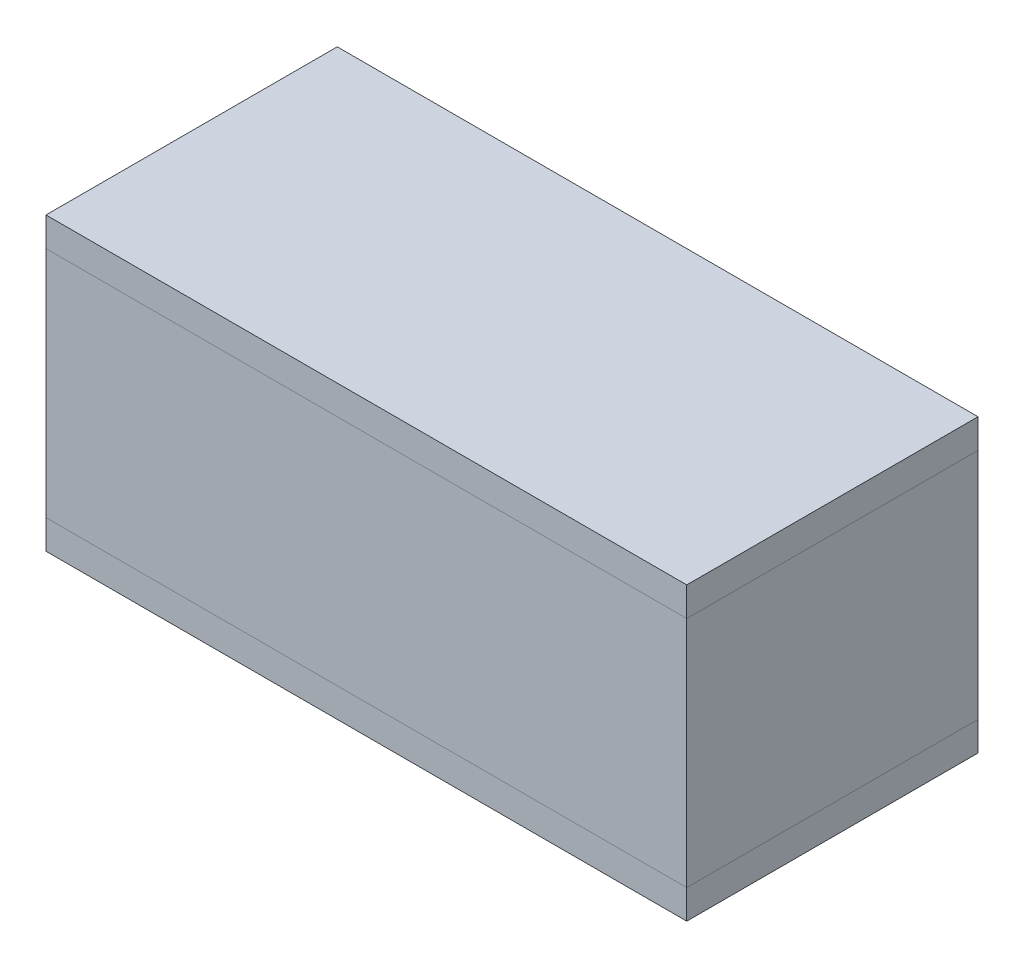
ISO-10303-21;
HEADER;
FILE_DESCRIPTION(('STEP AP214'),'2;1');
FILE_NAME('part.step','',(''),(''),'','','');
FILE_SCHEMA(('AUTOMOTIVE_DESIGN { 1 0 10303 214 1 1 1 1 }'));
ENDSEC;
DATA;
#1=APPLICATION_CONTEXT('core data for automotive mechanical design processes');
#2=APPLICATION_PROTOCOL_DEFINITION('international standard','automotive_design',2000,#1);
#3=PRODUCT_CONTEXT('',#1,'mechanical');
#4=PRODUCT('Part','Part','',(#3));
#5=PRODUCT_RELATED_PRODUCT_CATEGORY('part','',(#4));
#6=PRODUCT_DEFINITION_FORMATION('','',#4);
#7=PRODUCT_DEFINITION_CONTEXT('part definition',#1,'design');
#8=PRODUCT_DEFINITION('design','',#6,#7);
#9=PRODUCT_DEFINITION_SHAPE('','',#8);
#10=(LENGTH_UNIT() NAMED_UNIT(*) SI_UNIT(.MILLI.,.METRE.));
#11=(NAMED_UNIT(*) PLANE_ANGLE_UNIT() SI_UNIT($,.RADIAN.));
#12=(NAMED_UNIT(*) SI_UNIT($,.STERADIAN.) SOLID_ANGLE_UNIT());
#13=UNCERTAINTY_MEASURE_WITH_UNIT(LENGTH_MEASURE(1.E-05),#10,'distance_accuracy_value','');
#14=(GEOMETRIC_REPRESENTATION_CONTEXT(3) GLOBAL_UNCERTAINTY_ASSIGNED_CONTEXT((#13)) GLOBAL_UNIT_ASSIGNED_CONTEXT((#10,
#11,#12)) REPRESENTATION_CONTEXT('',''));
#15=CARTESIAN_POINT('',(0.,0.,0.));
#16=DIRECTION('',(0.,0.,1.));
#17=DIRECTION('',(1.,0.,0.));
#18=AXIS2_PLACEMENT_3D('',#15,#16,#17);
#19=CARTESIAN_POINT('',(0.,45.,0.));
#20=DIRECTION('',(0.,1.,0.));
#21=DIRECTION('',(0.,0.,1.));
#22=AXIS2_PLACEMENT_3D('',#19,#20,#21);
#23=PLANE('',#22);
#24=DIRECTION('',(-1.,0.,0.));
#25=VECTOR('',#24,1.);
#26=CARTESIAN_POINT('',(-40.9090909090909,45.,-19.1136363636364));
#27=LINE('',#26,#25);
#28=CARTESIAN_POINT('',(69.0909090909091,45.,-19.1136363636364));
#29=VERTEX_POINT('',#28);
#30=CARTESIAN_POINT('',(-40.9090909090909,45.,-19.1136363636364));
#31=VERTEX_POINT('',#30);
#32=EDGE_CURVE('E114',#29,#31,#27,.T.);
#33=ORIENTED_EDGE('',*,*,#32,.T.);
#34=DIRECTION('',(0.,0.,1.));
#35=VECTOR('',#34,1.);
#36=CARTESIAN_POINT('',(-40.9090909090909,45.,-19.1136363636364));
#37=LINE('',#36,#35);
#38=CARTESIAN_POINT('',(-40.9090909090909,45.,30.8863636363636));
#39=VERTEX_POINT('',#38);
#40=EDGE_CURVE('E124',#31,#39,#37,.T.);
#41=ORIENTED_EDGE('',*,*,#40,.T.);
#42=DIRECTION('',(1.,0.,0.));
#43=VECTOR('',#42,1.);
#44=CARTESIAN_POINT('',(-40.9090909090909,45.,30.8863636363636));
#45=LINE('',#44,#43);
#46=CARTESIAN_POINT('',(69.0909090909091,45.,30.8863636363636));
#47=VERTEX_POINT('',#46);
#48=EDGE_CURVE('E146',#39,#47,#45,.T.);
#49=ORIENTED_EDGE('',*,*,#48,.T.);
#50=DIRECTION('',(0.,0.,-1.));
#51=VECTOR('',#50,1.);
#52=CARTESIAN_POINT('',(69.0909090909091,45.,-19.1136363636364));
#53=LINE('',#52,#51);
#54=EDGE_CURVE('E135',#47,#29,#53,.T.);
#55=ORIENTED_EDGE('',*,*,#54,.T.);
#56=EDGE_LOOP('',(#33,#41,#49,#55));
#57=FACE_BOUND('',#56,.T.);
#58=DIRECTION('',(0.,0.,1.));
#59=VECTOR('',#58,1.);
#60=CARTESIAN_POINT('',(-39.4090909090909,45.,-19.1136363636364));
#61=LINE('',#60,#59);
#62=CARTESIAN_POINT('',(-39.4090909090909,45.,-17.6136363636364));
#63=VERTEX_POINT('',#62);
#64=CARTESIAN_POINT('',(-39.4090909090909,45.,29.3863636363636));
#65=VERTEX_POINT('',#64);
#66=EDGE_CURVE('E130',#63,#65,#61,.T.);
#67=ORIENTED_EDGE('',*,*,#66,.F.);
#68=DIRECTION('',(-1.,0.,0.));
#69=VECTOR('',#68,1.);
#70=CARTESIAN_POINT('',(-40.9090909090909,45.,-17.6136363636364));
#71=LINE('',#70,#69);
#72=CARTESIAN_POINT('',(67.5909090909091,45.,-17.6136363636364));
#73=VERTEX_POINT('',#72);
#74=EDGE_CURVE('E49',#73,#63,#71,.T.);
#75=ORIENTED_EDGE('',*,*,#74,.F.);
#76=DIRECTION('',(0.,0.,-1.));
#77=VECTOR('',#76,1.);
#78=CARTESIAN_POINT('',(67.5909090909091,45.,-19.1136363636364));
#79=LINE('',#78,#77);
#80=CARTESIAN_POINT('',(67.5909090909091,45.,29.3863636363636));
#81=VERTEX_POINT('',#80);
#82=EDGE_CURVE('E154',#81,#73,#79,.T.);
#83=ORIENTED_EDGE('',*,*,#82,.F.);
#84=DIRECTION('',(1.,0.,0.));
#85=VECTOR('',#84,1.);
#86=CARTESIAN_POINT('',(-40.9090909090909,45.,29.3863636363636));
#87=LINE('',#86,#85);
#88=EDGE_CURVE('E151',#65,#81,#87,.T.);
#89=ORIENTED_EDGE('',*,*,#88,.F.);
#90=EDGE_LOOP('',(#67,#75,#83,#89));
#91=FACE_BOUND('',#90,.T.);
#92=ADVANCED_FACE('F45',(#57,#91),#23,.T.);
#93=CARTESIAN_POINT('',(0.,4.99999999999999,0.));
#94=DIRECTION('',(0.,-1.,0.));
#95=DIRECTION('',(1.,0.,0.));
#96=AXIS2_PLACEMENT_3D('',#93,#94,#95);
#97=PLANE('',#96);
#98=DIRECTION('',(-1.,0.,0.));
#99=VECTOR('',#98,1.);
#100=CARTESIAN_POINT('',(-40.9090909090909,4.99999999999998,30.8863636363636));
#101=LINE('',#100,#99);
#102=CARTESIAN_POINT('',(69.0909090909091,5.,30.8863636363636));
#103=VERTEX_POINT('',#102);
#104=CARTESIAN_POINT('',(-40.9090909090909,4.99999999999999,30.8863636363636));
#105=VERTEX_POINT('',#104);
#106=EDGE_CURVE('E145',#103,#105,#101,.T.);
#107=ORIENTED_EDGE('',*,*,#106,.T.);
#108=DIRECTION('',(0.,0.,-1.));
#109=VECTOR('',#108,1.);
#110=CARTESIAN_POINT('',(-40.9090909090909,4.99999999999998,-19.1136363636364));
#111=LINE('',#110,#109);
#112=CARTESIAN_POINT('',(-40.9090909090909,4.99999999999999,-19.1136363636364));
#113=VERTEX_POINT('',#112);
#114=EDGE_CURVE('E131',#105,#113,#111,.T.);
#115=ORIENTED_EDGE('',*,*,#114,.T.);
#116=DIRECTION('',(1.,0.,0.));
#117=VECTOR('',#116,1.);
#118=CARTESIAN_POINT('',(-40.9090909090909,4.99999999999998,-19.1136363636364));
#119=LINE('',#118,#117);
#120=CARTESIAN_POINT('',(69.0909090909091,4.99999999999999,-19.1136363636364));
#121=VERTEX_POINT('',#120);
#122=EDGE_CURVE('E116',#113,#121,#119,.T.);
#123=ORIENTED_EDGE('',*,*,#122,.T.);
#124=DIRECTION('',(0.,0.,1.));
#125=VECTOR('',#124,1.);
#126=CARTESIAN_POINT('',(69.0909090909091,5.,-19.1136363636364));
#127=LINE('',#126,#125);
#128=EDGE_CURVE('E136',#121,#103,#127,.T.);
#129=ORIENTED_EDGE('',*,*,#128,.T.);
#130=EDGE_LOOP('',(#107,#115,#123,#129));
#131=FACE_BOUND('',#130,.T.);
#132=DIRECTION('',(0.,0.,-1.));
#133=VECTOR('',#132,1.);
#134=CARTESIAN_POINT('',(-39.4090909090909,4.99999999999998,-19.1136363636364));
#135=LINE('',#134,#133);
#136=CARTESIAN_POINT('',(-39.4090909090909,4.99999999999999,29.3863636363636));
#137=VERTEX_POINT('',#136);
#138=CARTESIAN_POINT('',(-39.4090909090909,4.99999999999999,-17.6136363636364));
#139=VERTEX_POINT('',#138);
#140=EDGE_CURVE('E150',#137,#139,#135,.T.);
#141=ORIENTED_EDGE('',*,*,#140,.F.);
#142=DIRECTION('',(-1.,0.,0.));
#143=VECTOR('',#142,1.);
#144=CARTESIAN_POINT('',(-40.9090909090909,4.99999999999998,29.3863636363636));
#145=LINE('',#144,#143);
#146=CARTESIAN_POINT('',(67.5909090909091,5.,29.3863636363636));
#147=VERTEX_POINT('',#146);
#148=EDGE_CURVE('E153',#147,#137,#145,.T.);
#149=ORIENTED_EDGE('',*,*,#148,.F.);
#150=DIRECTION('',(0.,0.,1.));
#151=VECTOR('',#150,1.);
#152=CARTESIAN_POINT('',(67.5909090909091,5.,-19.1136363636364));
#153=LINE('',#152,#151);
#154=CARTESIAN_POINT('',(67.5909090909091,4.99999999999999,-17.6136363636364));
#155=VERTEX_POINT('',#154);
#156=EDGE_CURVE('E155',#155,#147,#153,.T.);
#157=ORIENTED_EDGE('',*,*,#156,.F.);
#158=DIRECTION('',(1.,0.,0.));
#159=VECTOR('',#158,1.);
#160=CARTESIAN_POINT('',(-40.9090909090909,4.99999999999998,-17.6136363636364));
#161=LINE('',#160,#159);
#162=EDGE_CURVE('E68',#139,#155,#161,.T.);
#163=ORIENTED_EDGE('',*,*,#162,.F.);
#164=EDGE_LOOP('',(#141,#149,#157,#163));
#165=FACE_BOUND('',#164,.T.);
#166=ADVANCED_FACE('F188',(#131,#165),#97,.T.);
#167=CARTESIAN_POINT('',(-40.9090909090909,48.,29.3863636363636));
#168=DIRECTION('',(0.,0.,-1.));
#169=DIRECTION('',(-1.,0.,0.));
#170=AXIS2_PLACEMENT_3D('',#167,#168,#169);
#171=PLANE('',#170);
#172=DIRECTION('',(0.,-1.,0.));
#173=VECTOR('',#172,1.);
#174=CARTESIAN_POINT('',(-39.4090909090909,48.,29.3863636363636));
#175=LINE('',#174,#173);
#176=EDGE_CURVE('E120',#65,#137,#175,.T.);
#177=ORIENTED_EDGE('',*,*,#176,.F.);
#178=ORIENTED_EDGE('',*,*,#88,.T.);
#179=DIRECTION('',(0.,-1.,0.));
#180=VECTOR('',#179,1.);
#181=CARTESIAN_POINT('',(67.5909090909091,48.,29.3863636363636));
#182=LINE('',#181,#180);
#183=EDGE_CURVE('E174',#81,#147,#182,.T.);
#184=ORIENTED_EDGE('',*,*,#183,.T.);
#185=ORIENTED_EDGE('',*,*,#148,.T.);
#186=EDGE_LOOP('',(#177,#178,#184,#185));
#187=FACE_BOUND('',#186,.T.);
#188=ADVANCED_FACE('F198',(#187),#171,.T.);
#189=CARTESIAN_POINT('',(-39.4090909090909,48.,-19.1136363636364));
#190=DIRECTION('',(1.,0.,0.));
#191=DIRECTION('',(0.,0.,-1.));
#192=AXIS2_PLACEMENT_3D('',#189,#190,#191);
#193=PLANE('',#192);
#194=DIRECTION('',(0.,-1.,0.));
#195=VECTOR('',#194,1.);
#196=CARTESIAN_POINT('',(-39.4090909090909,48.,-17.6136363636364));
#197=LINE('',#196,#195);
#198=EDGE_CURVE('E12',#63,#139,#197,.T.);
#199=ORIENTED_EDGE('',*,*,#198,.F.);
#200=ORIENTED_EDGE('',*,*,#66,.T.);
#201=ORIENTED_EDGE('',*,*,#176,.T.);
#202=ORIENTED_EDGE('',*,*,#140,.T.);
#203=EDGE_LOOP('',(#199,#200,#201,#202));
#204=FACE_BOUND('',#203,.T.);
#205=ADVANCED_FACE('F186',(#204),#193,.T.);
#206=CARTESIAN_POINT('',(67.5909090909091,48.,-19.1136363636364));
#207=DIRECTION('',(-1.,0.,0.));
#208=DIRECTION('',(0.,0.,1.));
#209=AXIS2_PLACEMENT_3D('',#206,#207,#208);
#210=PLANE('',#209);
#211=ORIENTED_EDGE('',*,*,#183,.F.);
#212=ORIENTED_EDGE('',*,*,#82,.T.);
#213=DIRECTION('',(0.,-1.,0.));
#214=VECTOR('',#213,1.);
#215=CARTESIAN_POINT('',(67.5909090909091,48.,-17.6136363636364));
#216=LINE('',#215,#214);
#217=EDGE_CURVE('E54',#73,#155,#216,.T.);
#218=ORIENTED_EDGE('',*,*,#217,.T.);
#219=ORIENTED_EDGE('',*,*,#156,.T.);
#220=EDGE_LOOP('',(#211,#212,#218,#219));
#221=FACE_BOUND('',#220,.T.);
#222=ADVANCED_FACE('F189',(#221),#210,.T.);
#223=CARTESIAN_POINT('',(-40.9090909090909,48.,-17.6136363636364));
#224=DIRECTION('',(0.,0.,1.));
#225=DIRECTION('',(1.,0.,0.));
#226=AXIS2_PLACEMENT_3D('',#223,#224,#225);
#227=PLANE('',#226);
#228=ORIENTED_EDGE('',*,*,#217,.F.);
#229=ORIENTED_EDGE('',*,*,#74,.T.);
#230=ORIENTED_EDGE('',*,*,#198,.T.);
#231=ORIENTED_EDGE('',*,*,#162,.T.);
#232=EDGE_LOOP('',(#228,#229,#230,#231));
#233=FACE_BOUND('',#232,.T.);
#234=ADVANCED_FACE('F183',(#233),#227,.T.);
#235=CARTESIAN_POINT('',(-40.9090909090909,50.,30.8863636363636));
#236=DIRECTION('',(0.,0.,-1.));
#237=DIRECTION('',(-1.,0.,0.));
#238=AXIS2_PLACEMENT_3D('',#235,#236,#237);
#239=PLANE('',#238);
#240=ORIENTED_EDGE('',*,*,#48,.F.);
#241=DIRECTION('',(0.,-1.,0.));
#242=VECTOR('',#241,1.);
#243=CARTESIAN_POINT('',(-40.9090909090909,50.,30.8863636363636));
#244=LINE('',#243,#242);
#245=EDGE_CURVE('E126',#39,#105,#244,.T.);
#246=ORIENTED_EDGE('',*,*,#245,.T.);
#247=ORIENTED_EDGE('',*,*,#106,.F.);
#248=DIRECTION('',(0.,-1.,0.));
#249=VECTOR('',#248,1.);
#250=CARTESIAN_POINT('',(69.0909090909091,50.,30.8863636363636));
#251=LINE('',#250,#249);
#252=EDGE_CURVE('E178',#47,#103,#251,.T.);
#253=ORIENTED_EDGE('',*,*,#252,.F.);
#254=EDGE_LOOP('',(#240,#246,#247,#253));
#255=FACE_BOUND('',#254,.T.);
#256=ADVANCED_FACE('F196',(#255),#239,.F.);
#257=CARTESIAN_POINT('',(-40.9090909090909,50.,-19.1136363636364));
#258=DIRECTION('',(1.,0.,0.));
#259=DIRECTION('',(0.,0.,-1.));
#260=AXIS2_PLACEMENT_3D('',#257,#258,#259);
#261=PLANE('',#260);
#262=ORIENTED_EDGE('',*,*,#40,.F.);
#263=DIRECTION('',(0.,-1.,0.));
#264=VECTOR('',#263,1.);
#265=CARTESIAN_POINT('',(-40.9090909090909,50.,-19.1136363636364));
#266=LINE('',#265,#264);
#267=EDGE_CURVE('E111',#31,#113,#266,.T.);
#268=ORIENTED_EDGE('',*,*,#267,.T.);
#269=ORIENTED_EDGE('',*,*,#114,.F.);
#270=ORIENTED_EDGE('',*,*,#245,.F.);
#271=EDGE_LOOP('',(#262,#268,#269,#270));
#272=FACE_BOUND('',#271,.T.);
#273=ADVANCED_FACE('F125',(#272),#261,.F.);
#274=CARTESIAN_POINT('',(69.0909090909091,50.,-19.1136363636364));
#275=DIRECTION('',(-1.,0.,0.));
#276=DIRECTION('',(0.,0.,1.));
#277=AXIS2_PLACEMENT_3D('',#274,#275,#276);
#278=PLANE('',#277);
#279=ORIENTED_EDGE('',*,*,#54,.F.);
#280=ORIENTED_EDGE('',*,*,#252,.T.);
#281=ORIENTED_EDGE('',*,*,#128,.F.);
#282=DIRECTION('',(0.,-1.,0.));
#283=VECTOR('',#282,1.);
#284=CARTESIAN_POINT('',(69.0909090909091,50.,-19.1136363636364));
#285=LINE('',#284,#283);
#286=EDGE_CURVE('E121',#29,#121,#285,.T.);
#287=ORIENTED_EDGE('',*,*,#286,.F.);
#288=EDGE_LOOP('',(#279,#280,#281,#287));
#289=FACE_BOUND('',#288,.T.);
#290=ADVANCED_FACE('F212',(#289),#278,.F.);
#291=CARTESIAN_POINT('',(-40.9090909090909,50.,-19.1136363636364));
#292=DIRECTION('',(0.,0.,1.));
#293=DIRECTION('',(1.,0.,0.));
#294=AXIS2_PLACEMENT_3D('',#291,#292,#293);
#295=PLANE('',#294);
#296=ORIENTED_EDGE('',*,*,#32,.F.);
#297=ORIENTED_EDGE('',*,*,#286,.T.);
#298=ORIENTED_EDGE('',*,*,#122,.F.);
#299=ORIENTED_EDGE('',*,*,#267,.F.);
#300=EDGE_LOOP('',(#296,#297,#298,#299));
#301=FACE_BOUND('',#300,.T.);
#302=ADVANCED_FACE('F47',(#301),#295,.F.);
#303=CLOSED_SHELL('',(#92,#166,#188,#205,#222,#234,#256,#273,#290,#302));
#304=MANIFOLD_SOLID_BREP('B2',#303);
#305=CARTESIAN_POINT('',(0.,45.,0.));
#306=DIRECTION('',(0.,1.,0.));
#307=DIRECTION('',(0.,0.,1.));
#308=AXIS2_PLACEMENT_3D('',#305,#306,#307);
#309=PLANE('',#308);
#310=DIRECTION('',(0.,0.,1.));
#311=VECTOR('',#310,1.);
#312=CARTESIAN_POINT('',(-39.4090909090909,45.,-19.1136363636364));
#313=LINE('',#312,#311);
#314=CARTESIAN_POINT('',(-39.4090909090909,45.,-17.6136363636364));
#315=VERTEX_POINT('',#314);
#316=CARTESIAN_POINT('',(-39.4090909090909,45.,29.3863636363636));
#317=VERTEX_POINT('',#316);
#318=EDGE_CURVE('E374',#315,#317,#313,.T.);
#319=ORIENTED_EDGE('',*,*,#318,.T.);
#320=DIRECTION('',(1.,0.,0.));
#321=VECTOR('',#320,1.);
#322=CARTESIAN_POINT('',(-40.9090909090909,45.,29.3863636363636));
#323=LINE('',#322,#321);
#324=CARTESIAN_POINT('',(67.5909090909091,45.,29.3863636363636));
#325=VERTEX_POINT('',#324);
#326=EDGE_CURVE('E362',#317,#325,#323,.T.);
#327=ORIENTED_EDGE('',*,*,#326,.T.);
#328=DIRECTION('',(0.,0.,-1.));
#329=VECTOR('',#328,1.);
#330=CARTESIAN_POINT('',(67.5909090909091,45.,-19.1136363636364));
#331=LINE('',#330,#329);
#332=CARTESIAN_POINT('',(67.5909090909091,45.,-17.6136363636364));
#333=VERTEX_POINT('',#332);
#334=EDGE_CURVE('E359',#325,#333,#331,.T.);
#335=ORIENTED_EDGE('',*,*,#334,.T.);
#336=DIRECTION('',(-1.,0.,0.));
#337=VECTOR('',#336,1.);
#338=CARTESIAN_POINT('',(-40.9090909090909,45.,-17.6136363636364));
#339=LINE('',#338,#337);
#340=EDGE_CURVE('E287',#333,#315,#339,.T.);
#341=ORIENTED_EDGE('',*,*,#340,.T.);
#342=EDGE_LOOP('',(#319,#327,#335,#341));
#343=FACE_BOUND('',#342,.T.);
#344=DIRECTION('',(-1.,0.,0.));
#345=VECTOR('',#344,1.);
#346=CARTESIAN_POINT('',(-40.9090909090909,45.,-19.1136363636364));
#347=LINE('',#346,#345);
#348=CARTESIAN_POINT('',(69.0909090909091,45.,-19.1136363636364));
#349=VERTEX_POINT('',#348);
#350=CARTESIAN_POINT('',(-40.9090909090909,45.,-19.1136363636364));
#351=VERTEX_POINT('',#350);
#352=EDGE_CURVE('E388',#349,#351,#347,.T.);
#353=ORIENTED_EDGE('',*,*,#352,.F.);
#354=DIRECTION('',(0.,0.,-1.));
#355=VECTOR('',#354,1.);
#356=CARTESIAN_POINT('',(69.0909090909091,45.,-19.1136363636364));
#357=LINE('',#356,#355);
#358=CARTESIAN_POINT('',(69.0909090909091,45.,30.8863636363636));
#359=VERTEX_POINT('',#358);
#360=EDGE_CURVE('E384',#359,#349,#357,.T.);
#361=ORIENTED_EDGE('',*,*,#360,.F.);
#362=DIRECTION('',(1.,0.,0.));
#363=VECTOR('',#362,1.);
#364=CARTESIAN_POINT('',(-40.9090909090909,45.,30.8863636363636));
#365=LINE('',#364,#363);
#366=CARTESIAN_POINT('',(-40.9090909090909,45.,30.8863636363636));
#367=VERTEX_POINT('',#366);
#368=EDGE_CURVE('E378',#367,#359,#365,.T.);
#369=ORIENTED_EDGE('',*,*,#368,.F.);
#370=DIRECTION('',(0.,0.,1.));
#371=VECTOR('',#370,1.);
#372=CARTESIAN_POINT('',(-40.9090909090909,45.,-19.1136363636364));
#373=LINE('',#372,#371);
#374=EDGE_CURVE('E376',#351,#367,#373,.T.);
#375=ORIENTED_EDGE('',*,*,#374,.F.);
#376=EDGE_LOOP('',(#353,#361,#369,#375));
#377=FACE_BOUND('',#376,.T.);
#378=ADVANCED_FACE('F283',(#343,#377),#309,.F.);
#379=CARTESIAN_POINT('',(-39.4090909090909,48.,-19.1136363636364));
#380=DIRECTION('',(1.,0.,0.));
#381=DIRECTION('',(0.,0.,-1.));
#382=AXIS2_PLACEMENT_3D('',#379,#380,#381);
#383=PLANE('',#382);
#384=ORIENTED_EDGE('',*,*,#318,.F.);
#385=DIRECTION('',(0.,-1.,0.));
#386=VECTOR('',#385,1.);
#387=CARTESIAN_POINT('',(-39.4090909090909,48.,-17.6136363636364));
#388=LINE('',#387,#386);
#389=CARTESIAN_POINT('',(-39.4090909090909,48.,-17.6136363636364));
#390=VERTEX_POINT('',#389);
#391=EDGE_CURVE('E355',#390,#315,#388,.T.);
#392=ORIENTED_EDGE('',*,*,#391,.F.);
#393=DIRECTION('',(0.,0.,1.));
#394=VECTOR('',#393,1.);
#395=CARTESIAN_POINT('',(-39.4090909090909,48.,-19.1136363636364));
#396=LINE('',#395,#394);
#397=CARTESIAN_POINT('',(-39.4090909090909,48.,29.3863636363636));
#398=VERTEX_POINT('',#397);
#399=EDGE_CURVE('E43',#390,#398,#396,.T.);
#400=ORIENTED_EDGE('',*,*,#399,.T.);
#401=DIRECTION('',(0.,-1.,0.));
#402=VECTOR('',#401,1.);
#403=CARTESIAN_POINT('',(-39.4090909090909,48.,29.3863636363636));
#404=LINE('',#403,#402);
#405=EDGE_CURVE('E370',#398,#317,#404,.T.);
#406=ORIENTED_EDGE('',*,*,#405,.T.);
#407=EDGE_LOOP('',(#384,#392,#400,#406));
#408=FACE_BOUND('',#407,.T.);
#409=ADVANCED_FACE('F414',(#408),#383,.T.);
#410=CARTESIAN_POINT('',(-40.9090909090909,48.,29.3863636363636));
#411=DIRECTION('',(0.,0.,-1.));
#412=DIRECTION('',(-1.,0.,0.));
#413=AXIS2_PLACEMENT_3D('',#410,#411,#412);
#414=PLANE('',#413);
#415=ORIENTED_EDGE('',*,*,#326,.F.);
#416=ORIENTED_EDGE('',*,*,#405,.F.);
#417=DIRECTION('',(1.,0.,0.));
#418=VECTOR('',#417,1.);
#419=CARTESIAN_POINT('',(-40.9090909090909,48.,29.3863636363636));
#420=LINE('',#419,#418);
#421=CARTESIAN_POINT('',(67.5909090909091,48.,29.3863636363636));
#422=VERTEX_POINT('',#421);
#423=EDGE_CURVE('E292',#398,#422,#420,.T.);
#424=ORIENTED_EDGE('',*,*,#423,.T.);
#425=DIRECTION('',(0.,-1.,0.));
#426=VECTOR('',#425,1.);
#427=CARTESIAN_POINT('',(67.5909090909091,48.,29.3863636363636));
#428=LINE('',#427,#426);
#429=EDGE_CURVE('E366',#422,#325,#428,.T.);
#430=ORIENTED_EDGE('',*,*,#429,.T.);
#431=EDGE_LOOP('',(#415,#416,#424,#430));
#432=FACE_BOUND('',#431,.T.);
#433=ADVANCED_FACE('F415',(#432),#414,.T.);
#434=CARTESIAN_POINT('',(67.5909090909091,48.,-19.1136363636364));
#435=DIRECTION('',(-1.,0.,0.));
#436=DIRECTION('',(0.,0.,1.));
#437=AXIS2_PLACEMENT_3D('',#434,#435,#436);
#438=PLANE('',#437);
#439=ORIENTED_EDGE('',*,*,#334,.F.);
#440=ORIENTED_EDGE('',*,*,#429,.F.);
#441=DIRECTION('',(0.,0.,-1.));
#442=VECTOR('',#441,1.);
#443=CARTESIAN_POINT('',(67.5909090909091,48.,-19.1136363636364));
#444=LINE('',#443,#442);
#445=CARTESIAN_POINT('',(67.5909090909091,48.,-17.6136363636364));
#446=VERTEX_POINT('',#445);
#447=EDGE_CURVE('E365',#422,#446,#444,.T.);
#448=ORIENTED_EDGE('',*,*,#447,.T.);
#449=DIRECTION('',(0.,-1.,0.));
#450=VECTOR('',#449,1.);
#451=CARTESIAN_POINT('',(67.5909090909091,48.,-17.6136363636364));
#452=LINE('',#451,#450);
#453=EDGE_CURVE('E352',#446,#333,#452,.T.);
#454=ORIENTED_EDGE('',*,*,#453,.T.);
#455=EDGE_LOOP('',(#439,#440,#448,#454));
#456=FACE_BOUND('',#455,.T.);
#457=ADVANCED_FACE('F364',(#456),#438,.T.);
#458=CARTESIAN_POINT('',(-40.9090909090909,48.,-17.6136363636364));
#459=DIRECTION('',(0.,0.,1.));
#460=DIRECTION('',(1.,0.,0.));
#461=AXIS2_PLACEMENT_3D('',#458,#459,#460);
#462=PLANE('',#461);
#463=ORIENTED_EDGE('',*,*,#340,.F.);
#464=ORIENTED_EDGE('',*,*,#453,.F.);
#465=DIRECTION('',(-1.,0.,0.));
#466=VECTOR('',#465,1.);
#467=CARTESIAN_POINT('',(-40.9090909090909,48.,-17.6136363636364));
#468=LINE('',#467,#466);
#469=EDGE_CURVE('E368',#446,#390,#468,.T.);
#470=ORIENTED_EDGE('',*,*,#469,.T.);
#471=ORIENTED_EDGE('',*,*,#391,.T.);
#472=EDGE_LOOP('',(#463,#464,#470,#471));
#473=FACE_BOUND('',#472,.T.);
#474=ADVANCED_FACE('F350',(#473),#462,.T.);
#475=CARTESIAN_POINT('',(0.,48.,0.));
#476=DIRECTION('',(0.,1.,0.));
#477=DIRECTION('',(0.,0.,1.));
#478=AXIS2_PLACEMENT_3D('',#475,#476,#477);
#479=PLANE('',#478);
#480=ORIENTED_EDGE('',*,*,#399,.F.);
#481=ORIENTED_EDGE('',*,*,#469,.F.);
#482=ORIENTED_EDGE('',*,*,#447,.F.);
#483=ORIENTED_EDGE('',*,*,#423,.F.);
#484=EDGE_LOOP('',(#480,#481,#482,#483));
#485=FACE_BOUND('',#484,.T.);
#486=ADVANCED_FACE('F416',(#485),#479,.F.);
#487=CARTESIAN_POINT('',(-40.9090909090909,50.,-19.1136363636364));
#488=DIRECTION('',(1.,0.,0.));
#489=DIRECTION('',(0.,0.,-1.));
#490=AXIS2_PLACEMENT_3D('',#487,#488,#489);
#491=PLANE('',#490);
#492=DIRECTION('',(0.,-1.,0.));
#493=VECTOR('',#492,1.);
#494=CARTESIAN_POINT('',(-40.9090909090909,50.,-19.1136363636364));
#495=LINE('',#494,#493);
#496=CARTESIAN_POINT('',(-40.9090909090909,50.,-19.1136363636364));
#497=VERTEX_POINT('',#496);
#498=EDGE_CURVE('E395',#497,#351,#495,.T.);
#499=ORIENTED_EDGE('',*,*,#498,.T.);
#500=ORIENTED_EDGE('',*,*,#374,.T.);
#501=DIRECTION('',(0.,-1.,0.));
#502=VECTOR('',#501,1.);
#503=CARTESIAN_POINT('',(-40.9090909090909,50.,30.8863636363636));
#504=LINE('',#503,#502);
#505=CARTESIAN_POINT('',(-40.9090909090909,50.,30.8863636363636));
#506=VERTEX_POINT('',#505);
#507=EDGE_CURVE('E391',#506,#367,#504,.T.);
#508=ORIENTED_EDGE('',*,*,#507,.F.);
#509=DIRECTION('',(0.,0.,1.));
#510=VECTOR('',#509,1.);
#511=CARTESIAN_POINT('',(-40.9090909090909,50.,-19.1136363636364));
#512=LINE('',#511,#510);
#513=EDGE_CURVE('E399',#497,#506,#512,.T.);
#514=ORIENTED_EDGE('',*,*,#513,.F.);
#515=EDGE_LOOP('',(#499,#500,#508,#514));
#516=FACE_BOUND('',#515,.T.);
#517=ADVANCED_FACE('F418',(#516),#491,.F.);
#518=CARTESIAN_POINT('',(-40.9090909090909,50.,30.8863636363636));
#519=DIRECTION('',(0.,0.,-1.));
#520=DIRECTION('',(-1.,0.,0.));
#521=AXIS2_PLACEMENT_3D('',#518,#519,#520);
#522=PLANE('',#521);
#523=ORIENTED_EDGE('',*,*,#507,.T.);
#524=ORIENTED_EDGE('',*,*,#368,.T.);
#525=DIRECTION('',(0.,-1.,0.));
#526=VECTOR('',#525,1.);
#527=CARTESIAN_POINT('',(69.0909090909091,50.,30.8863636363636));
#528=LINE('',#527,#526);
#529=CARTESIAN_POINT('',(69.0909090909091,50.,30.8863636363636));
#530=VERTEX_POINT('',#529);
#531=EDGE_CURVE('E407',#530,#359,#528,.T.);
#532=ORIENTED_EDGE('',*,*,#531,.F.);
#533=DIRECTION('',(1.,0.,0.));
#534=VECTOR('',#533,1.);
#535=CARTESIAN_POINT('',(-40.9090909090909,50.,30.8863636363636));
#536=LINE('',#535,#534);
#537=EDGE_CURVE('E397',#506,#530,#536,.T.);
#538=ORIENTED_EDGE('',*,*,#537,.F.);
#539=EDGE_LOOP('',(#523,#524,#532,#538));
#540=FACE_BOUND('',#539,.T.);
#541=ADVANCED_FACE('F424',(#540),#522,.F.);
#542=CARTESIAN_POINT('',(69.0909090909091,50.,-19.1136363636364));
#543=DIRECTION('',(-1.,0.,0.));
#544=DIRECTION('',(0.,0.,1.));
#545=AXIS2_PLACEMENT_3D('',#542,#543,#544);
#546=PLANE('',#545);
#547=ORIENTED_EDGE('',*,*,#531,.T.);
#548=ORIENTED_EDGE('',*,*,#360,.T.);
#549=DIRECTION('',(0.,-1.,0.));
#550=VECTOR('',#549,1.);
#551=CARTESIAN_POINT('',(69.0909090909091,50.,-19.1136363636364));
#552=LINE('',#551,#550);
#553=CARTESIAN_POINT('',(69.0909090909091,50.,-19.1136363636364));
#554=VERTEX_POINT('',#553);
#555=EDGE_CURVE('E410',#554,#349,#552,.T.);
#556=ORIENTED_EDGE('',*,*,#555,.F.);
#557=DIRECTION('',(0.,0.,-1.));
#558=VECTOR('',#557,1.);
#559=CARTESIAN_POINT('',(69.0909090909091,50.,-19.1136363636364));
#560=LINE('',#559,#558);
#561=EDGE_CURVE('E394',#530,#554,#560,.T.);
#562=ORIENTED_EDGE('',*,*,#561,.F.);
#563=EDGE_LOOP('',(#547,#548,#556,#562));
#564=FACE_BOUND('',#563,.T.);
#565=ADVANCED_FACE('F440',(#564),#546,.F.);
#566=CARTESIAN_POINT('',(-40.9090909090909,50.,-19.1136363636364));
#567=DIRECTION('',(0.,0.,1.));
#568=DIRECTION('',(1.,0.,0.));
#569=AXIS2_PLACEMENT_3D('',#566,#567,#568);
#570=PLANE('',#569);
#571=ORIENTED_EDGE('',*,*,#555,.T.);
#572=ORIENTED_EDGE('',*,*,#352,.T.);
#573=ORIENTED_EDGE('',*,*,#498,.F.);
#574=DIRECTION('',(-1.,0.,0.));
#575=VECTOR('',#574,1.);
#576=CARTESIAN_POINT('',(-40.9090909090909,50.,-19.1136363636364));
#577=LINE('',#576,#575);
#578=EDGE_CURVE('E392',#554,#497,#577,.T.);
#579=ORIENTED_EDGE('',*,*,#578,.F.);
#580=EDGE_LOOP('',(#571,#572,#573,#579));
#581=FACE_BOUND('',#580,.T.);
#582=ADVANCED_FACE('F285',(#581),#570,.F.);
#583=CARTESIAN_POINT('',(0.,50.,0.));
#584=DIRECTION('',(0.,1.,0.));
#585=DIRECTION('',(0.,0.,1.));
#586=AXIS2_PLACEMENT_3D('',#583,#584,#585);
#587=PLANE('',#586);
#588=ORIENTED_EDGE('',*,*,#513,.T.);
#589=ORIENTED_EDGE('',*,*,#537,.T.);
#590=ORIENTED_EDGE('',*,*,#561,.T.);
#591=ORIENTED_EDGE('',*,*,#578,.T.);
#592=EDGE_LOOP('',(#588,#589,#590,#591));
#593=FACE_BOUND('',#592,.T.);
#594=ADVANCED_FACE('F431',(#593),#587,.T.);
#595=CLOSED_SHELL('',(#378,#409,#433,#457,#474,#486,#517,#541,#565,#582,#594));
#596=MANIFOLD_SOLID_BREP('B6',#595);
#597=CARTESIAN_POINT('',(0.,4.99999999999999,0.));
#598=DIRECTION('',(0.,-1.,0.));
#599=DIRECTION('',(1.,0.,0.));
#600=AXIS2_PLACEMENT_3D('',#597,#598,#599);
#601=PLANE('',#600);
#602=DIRECTION('',(0.,0.,-1.));
#603=VECTOR('',#602,1.);
#604=CARTESIAN_POINT('',(-39.4090909090909,4.99999999999998,-19.1136363636364));
#605=LINE('',#604,#603);
#606=CARTESIAN_POINT('',(-39.4090909090909,4.99999999999999,29.3863636363636));
#607=VERTEX_POINT('',#606);
#608=CARTESIAN_POINT('',(-39.4090909090909,4.99999999999999,-17.6136363636364));
#609=VERTEX_POINT('',#608);
#610=EDGE_CURVE('E593',#607,#609,#605,.T.);
#611=ORIENTED_EDGE('',*,*,#610,.T.);
#612=DIRECTION('',(1.,0.,0.));
#613=VECTOR('',#612,1.);
#614=CARTESIAN_POINT('',(-40.9090909090909,4.99999999999998,-17.6136363636364));
#615=LINE('',#614,#613);
#616=CARTESIAN_POINT('',(67.5909090909091,4.99999999999999,-17.6136363636364));
#617=VERTEX_POINT('',#616);
#618=EDGE_CURVE('E281',#609,#617,#615,.T.);
#619=ORIENTED_EDGE('',*,*,#618,.T.);
#620=DIRECTION('',(0.,0.,1.));
#621=VECTOR('',#620,1.);
#622=CARTESIAN_POINT('',(67.5909090909091,5.,-19.1136363636364));
#623=LINE('',#622,#621);
#624=CARTESIAN_POINT('',(67.5909090909091,5.,29.3863636363636));
#625=VERTEX_POINT('',#624);
#626=EDGE_CURVE('E530',#617,#625,#623,.T.);
#627=ORIENTED_EDGE('',*,*,#626,.T.);
#628=DIRECTION('',(-1.,0.,0.));
#629=VECTOR('',#628,1.);
#630=CARTESIAN_POINT('',(-40.9090909090909,4.99999999999998,29.3863636363636));
#631=LINE('',#630,#629);
#632=EDGE_CURVE('E640',#625,#607,#631,.T.);
#633=ORIENTED_EDGE('',*,*,#632,.T.);
#634=EDGE_LOOP('',(#611,#619,#627,#633));
#635=FACE_BOUND('',#634,.T.);
#636=DIRECTION('',(-1.,0.,0.));
#637=VECTOR('',#636,1.);
#638=CARTESIAN_POINT('',(-40.9090909090909,4.99999999999998,30.8863636363636));
#639=LINE('',#638,#637);
#640=CARTESIAN_POINT('',(69.0909090909091,5.,30.8863636363636));
#641=VERTEX_POINT('',#640);
#642=CARTESIAN_POINT('',(-40.9090909090909,4.99999999999999,30.8863636363636));
#643=VERTEX_POINT('',#642);
#644=EDGE_CURVE('E645',#641,#643,#639,.T.);
#645=ORIENTED_EDGE('',*,*,#644,.F.);
#646=DIRECTION('',(0.,0.,1.));
#647=VECTOR('',#646,1.);
#648=CARTESIAN_POINT('',(69.0909090909091,5.,-19.1136363636364));
#649=LINE('',#648,#647);
#650=CARTESIAN_POINT('',(69.0909090909091,4.99999999999999,-19.1136363636364));
#651=VERTEX_POINT('',#650);
#652=EDGE_CURVE('E644',#651,#641,#649,.T.);
#653=ORIENTED_EDGE('',*,*,#652,.F.);
#654=DIRECTION('',(1.,0.,0.));
#655=VECTOR('',#654,1.);
#656=CARTESIAN_POINT('',(-40.9090909090909,4.99999999999998,-19.1136363636364));
#657=LINE('',#656,#655);
#658=CARTESIAN_POINT('',(-40.9090909090909,4.99999999999999,-19.1136363636364));
#659=VERTEX_POINT('',#658);
#660=EDGE_CURVE('E637',#659,#651,#657,.T.);
#661=ORIENTED_EDGE('',*,*,#660,.F.);
#662=DIRECTION('',(0.,0.,-1.));
#663=VECTOR('',#662,1.);
#664=CARTESIAN_POINT('',(-40.9090909090909,4.99999999999998,-19.1136363636364));
#665=LINE('',#664,#663);
#666=EDGE_CURVE('E525',#643,#659,#665,.T.);
#667=ORIENTED_EDGE('',*,*,#666,.F.);
#668=EDGE_LOOP('',(#645,#653,#661,#667));
#669=FACE_BOUND('',#668,.T.);
#670=ADVANCED_FACE('F522',(#635,#669),#601,.F.);
#671=CARTESIAN_POINT('',(-40.9090909090909,48.,29.3863636363636));
#672=DIRECTION('',(0.,0.,-1.));
#673=DIRECTION('',(-1.,0.,0.));
#674=AXIS2_PLACEMENT_3D('',#671,#672,#673);
#675=PLANE('',#674);
#676=ORIENTED_EDGE('',*,*,#632,.F.);
#677=DIRECTION('',(0.,-1.,0.));
#678=VECTOR('',#677,1.);
#679=CARTESIAN_POINT('',(67.5909090909091,48.,29.3863636363636));
#680=LINE('',#679,#678);
#681=CARTESIAN_POINT('',(67.5909090909091,2.,29.3863636363636));
#682=VERTEX_POINT('',#681);
#683=EDGE_CURVE('E596',#625,#682,#680,.T.);
#684=ORIENTED_EDGE('',*,*,#683,.T.);
#685=DIRECTION('',(1.,0.,0.));
#686=VECTOR('',#685,1.);
#687=CARTESIAN_POINT('',(-40.9090909090909,2.,29.3863636363636));
#688=LINE('',#687,#686);
#689=CARTESIAN_POINT('',(-39.4090909090909,2.,29.3863636363636));
#690=VERTEX_POINT('',#689);
#691=EDGE_CURVE('E599',#690,#682,#688,.T.);
#692=ORIENTED_EDGE('',*,*,#691,.F.);
#693=DIRECTION('',(0.,-1.,0.));
#694=VECTOR('',#693,1.);
#695=CARTESIAN_POINT('',(-39.4090909090909,48.,29.3863636363636));
#696=LINE('',#695,#694);
#697=EDGE_CURVE('E587',#607,#690,#696,.T.);
#698=ORIENTED_EDGE('',*,*,#697,.F.);
#699=EDGE_LOOP('',(#676,#684,#692,#698));
#700=FACE_BOUND('',#699,.T.);
#701=ADVANCED_FACE('F600',(#700),#675,.T.);
#702=CARTESIAN_POINT('',(67.5909090909091,48.,-19.1136363636364));
#703=DIRECTION('',(-1.,0.,0.));
#704=DIRECTION('',(0.,0.,1.));
#705=AXIS2_PLACEMENT_3D('',#702,#703,#704);
#706=PLANE('',#705);
#707=ORIENTED_EDGE('',*,*,#626,.F.);
#708=DIRECTION('',(0.,-1.,0.));
#709=VECTOR('',#708,1.);
#710=CARTESIAN_POINT('',(67.5909090909091,48.,-17.6136363636364));
#711=LINE('',#710,#709);
#712=CARTESIAN_POINT('',(67.5909090909091,2.,-17.6136363636364));
#713=VERTEX_POINT('',#712);
#714=EDGE_CURVE('E616',#617,#713,#711,.T.);
#715=ORIENTED_EDGE('',*,*,#714,.T.);
#716=DIRECTION('',(0.,0.,-1.));
#717=VECTOR('',#716,1.);
#718=CARTESIAN_POINT('',(67.5909090909091,2.,-19.1136363636364));
#719=LINE('',#718,#717);
#720=EDGE_CURVE('E604',#682,#713,#719,.T.);
#721=ORIENTED_EDGE('',*,*,#720,.F.);
#722=ORIENTED_EDGE('',*,*,#683,.F.);
#723=EDGE_LOOP('',(#707,#715,#721,#722));
#724=FACE_BOUND('',#723,.T.);
#725=ADVANCED_FACE('F683',(#724),#706,.T.);
#726=CARTESIAN_POINT('',(0.,2.,0.));
#727=DIRECTION('',(0.,1.,0.));
#728=DIRECTION('',(0.,0.,1.));
#729=AXIS2_PLACEMENT_3D('',#726,#727,#728);
#730=PLANE('',#729);
#731=DIRECTION('',(0.,0.,1.));
#732=VECTOR('',#731,1.);
#733=CARTESIAN_POINT('',(-39.4090909090909,2.,-19.1136363636364));
#734=LINE('',#733,#732);
#735=CARTESIAN_POINT('',(-39.4090909090909,2.,-17.6136363636364));
#736=VERTEX_POINT('',#735);
#737=EDGE_CURVE('E592',#736,#690,#734,.T.);
#738=ORIENTED_EDGE('',*,*,#737,.T.);
#739=ORIENTED_EDGE('',*,*,#691,.T.);
#740=ORIENTED_EDGE('',*,*,#720,.T.);
#741=DIRECTION('',(-1.,0.,0.));
#742=VECTOR('',#741,1.);
#743=CARTESIAN_POINT('',(-40.9090909090909,2.,-17.6136363636364));
#744=LINE('',#743,#742);
#745=EDGE_CURVE('E609',#713,#736,#744,.T.);
#746=ORIENTED_EDGE('',*,*,#745,.T.);
#747=EDGE_LOOP('',(#738,#739,#740,#746));
#748=FACE_BOUND('',#747,.T.);
#749=ADVANCED_FACE('F607',(#748),#730,.T.);
#750=CARTESIAN_POINT('',(-39.4090909090909,48.,-19.1136363636364));
#751=DIRECTION('',(1.,0.,0.));
#752=DIRECTION('',(0.,0.,-1.));
#753=AXIS2_PLACEMENT_3D('',#750,#751,#752);
#754=PLANE('',#753);
#755=ORIENTED_EDGE('',*,*,#610,.F.);
#756=ORIENTED_EDGE('',*,*,#697,.T.);
#757=ORIENTED_EDGE('',*,*,#737,.F.);
#758=DIRECTION('',(0.,-1.,0.));
#759=VECTOR('',#758,1.);
#760=CARTESIAN_POINT('',(-39.4090909090909,48.,-17.6136363636364));
#761=LINE('',#760,#759);
#762=EDGE_CURVE('E614',#609,#736,#761,.T.);
#763=ORIENTED_EDGE('',*,*,#762,.F.);
#764=EDGE_LOOP('',(#755,#756,#757,#763));
#765=FACE_BOUND('',#764,.T.);
#766=ADVANCED_FACE('F589',(#765),#754,.T.);
#767=CARTESIAN_POINT('',(-40.9090909090909,48.,-17.6136363636364));
#768=DIRECTION('',(0.,0.,1.));
#769=DIRECTION('',(1.,0.,0.));
#770=AXIS2_PLACEMENT_3D('',#767,#768,#769);
#771=PLANE('',#770);
#772=ORIENTED_EDGE('',*,*,#618,.F.);
#773=ORIENTED_EDGE('',*,*,#762,.T.);
#774=ORIENTED_EDGE('',*,*,#745,.F.);
#775=ORIENTED_EDGE('',*,*,#714,.F.);
#776=EDGE_LOOP('',(#772,#773,#774,#775));
#777=FACE_BOUND('',#776,.T.);
#778=ADVANCED_FACE('F690',(#777),#771,.T.);
#779=CARTESIAN_POINT('',(-40.9090909090909,50.,30.8863636363636));
#780=DIRECTION('',(0.,0.,-1.));
#781=DIRECTION('',(-1.,0.,0.));
#782=AXIS2_PLACEMENT_3D('',#779,#780,#781);
#783=PLANE('',#782);
#784=DIRECTION('',(0.,-1.,0.));
#785=VECTOR('',#784,1.);
#786=CARTESIAN_POINT('',(69.0909090909091,50.,30.8863636363636));
#787=LINE('',#786,#785);
#788=CARTESIAN_POINT('',(69.0909090909091,0.,30.8863636363636));
#789=VERTEX_POINT('',#788);
#790=EDGE_CURVE('E634',#641,#789,#787,.T.);
#791=ORIENTED_EDGE('',*,*,#790,.F.);
#792=ORIENTED_EDGE('',*,*,#644,.T.);
#793=DIRECTION('',(0.,-1.,0.));
#794=VECTOR('',#793,1.);
#795=CARTESIAN_POINT('',(-40.9090909090909,50.,30.8863636363636));
#796=LINE('',#795,#794);
#797=CARTESIAN_POINT('',(-40.9090909090909,0.,30.8863636363636));
#798=VERTEX_POINT('',#797);
#799=EDGE_CURVE('E636',#643,#798,#796,.T.);
#800=ORIENTED_EDGE('',*,*,#799,.T.);
#801=DIRECTION('',(1.,0.,0.));
#802=VECTOR('',#801,1.);
#803=CARTESIAN_POINT('',(-40.9090909090909,0.,30.8863636363636));
#804=LINE('',#803,#802);
#805=EDGE_CURVE('E621',#798,#789,#804,.T.);
#806=ORIENTED_EDGE('',*,*,#805,.T.);
#807=EDGE_LOOP('',(#791,#792,#800,#806));
#808=FACE_BOUND('',#807,.T.);
#809=ADVANCED_FACE('F666',(#808),#783,.F.);
#810=CARTESIAN_POINT('',(0.,0.,0.));
#811=DIRECTION('',(0.,1.,0.));
#812=DIRECTION('',(0.,0.,1.));
#813=AXIS2_PLACEMENT_3D('',#810,#811,#812);
#814=PLANE('',#813);
#815=DIRECTION('',(0.,0.,1.));
#816=VECTOR('',#815,1.);
#817=CARTESIAN_POINT('',(-40.9090909090909,0.,-19.1136363636364));
#818=LINE('',#817,#816);
#819=CARTESIAN_POINT('',(-40.9090909090909,0.,-19.1136363636364));
#820=VERTEX_POINT('',#819);
#821=EDGE_CURVE('E595',#820,#798,#818,.T.);
#822=ORIENTED_EDGE('',*,*,#821,.F.);
#823=DIRECTION('',(-1.,0.,0.));
#824=VECTOR('',#823,1.);
#825=CARTESIAN_POINT('',(-40.9090909090909,0.,-19.1136363636364));
#826=LINE('',#825,#824);
#827=CARTESIAN_POINT('',(69.0909090909091,0.,-19.1136363636364));
#828=VERTEX_POINT('',#827);
#829=EDGE_CURVE('E627',#828,#820,#826,.T.);
#830=ORIENTED_EDGE('',*,*,#829,.F.);
#831=DIRECTION('',(0.,0.,-1.));
#832=VECTOR('',#831,1.);
#833=CARTESIAN_POINT('',(69.0909090909091,0.,-19.1136363636364));
#834=LINE('',#833,#832);
#835=EDGE_CURVE('E624',#789,#828,#834,.T.);
#836=ORIENTED_EDGE('',*,*,#835,.F.);
#837=ORIENTED_EDGE('',*,*,#805,.F.);
#838=EDGE_LOOP('',(#822,#830,#836,#837));
#839=FACE_BOUND('',#838,.T.);
#840=ADVANCED_FACE('F665',(#839),#814,.F.);
#841=CARTESIAN_POINT('',(69.0909090909091,50.,-19.1136363636364));
#842=DIRECTION('',(-1.,0.,0.));
#843=DIRECTION('',(0.,0.,1.));
#844=AXIS2_PLACEMENT_3D('',#841,#842,#843);
#845=PLANE('',#844);
#846=DIRECTION('',(0.,-1.,0.));
#847=VECTOR('',#846,1.);
#848=CARTESIAN_POINT('',(69.0909090909091,50.,-19.1136363636364));
#849=LINE('',#848,#847);
#850=EDGE_CURVE('E632',#651,#828,#849,.T.);
#851=ORIENTED_EDGE('',*,*,#850,.F.);
#852=ORIENTED_EDGE('',*,*,#652,.T.);
#853=ORIENTED_EDGE('',*,*,#790,.T.);
#854=ORIENTED_EDGE('',*,*,#835,.T.);
#855=EDGE_LOOP('',(#851,#852,#853,#854));
#856=FACE_BOUND('',#855,.T.);
#857=ADVANCED_FACE('F668',(#856),#845,.F.);
#858=CARTESIAN_POINT('',(-40.9090909090909,50.,-19.1136363636364));
#859=DIRECTION('',(1.,0.,0.));
#860=DIRECTION('',(0.,0.,-1.));
#861=AXIS2_PLACEMENT_3D('',#858,#859,#860);
#862=PLANE('',#861);
#863=ORIENTED_EDGE('',*,*,#799,.F.);
#864=ORIENTED_EDGE('',*,*,#666,.T.);
#865=DIRECTION('',(0.,-1.,0.));
#866=VECTOR('',#865,1.);
#867=CARTESIAN_POINT('',(-40.9090909090909,50.,-19.1136363636364));
#868=LINE('',#867,#866);
#869=EDGE_CURVE('E630',#659,#820,#868,.T.);
#870=ORIENTED_EDGE('',*,*,#869,.T.);
#871=ORIENTED_EDGE('',*,*,#821,.T.);
#872=EDGE_LOOP('',(#863,#864,#870,#871));
#873=FACE_BOUND('',#872,.T.);
#874=ADVANCED_FACE('F653',(#873),#862,.F.);
#875=CARTESIAN_POINT('',(-40.9090909090909,50.,-19.1136363636364));
#876=DIRECTION('',(0.,0.,1.));
#877=DIRECTION('',(1.,0.,0.));
#878=AXIS2_PLACEMENT_3D('',#875,#876,#877);
#879=PLANE('',#878);
#880=ORIENTED_EDGE('',*,*,#869,.F.);
#881=ORIENTED_EDGE('',*,*,#660,.T.);
#882=ORIENTED_EDGE('',*,*,#850,.T.);
#883=ORIENTED_EDGE('',*,*,#829,.T.);
#884=EDGE_LOOP('',(#880,#881,#882,#883));
#885=FACE_BOUND('',#884,.T.);
#886=ADVANCED_FACE('F659',(#885),#879,.F.);
#887=CLOSED_SHELL('',(#670,#701,#725,#749,#766,#778,#809,#840,#857,#874,#886));
#888=MANIFOLD_SOLID_BREP('B37',#887);
#889=ADVANCED_BREP_SHAPE_REPRESENTATION('',(#18,#304,#596,#888),#14);
#890=SHAPE_DEFINITION_REPRESENTATION(#9,#889);
ENDSEC;
END-ISO-10303-21;
